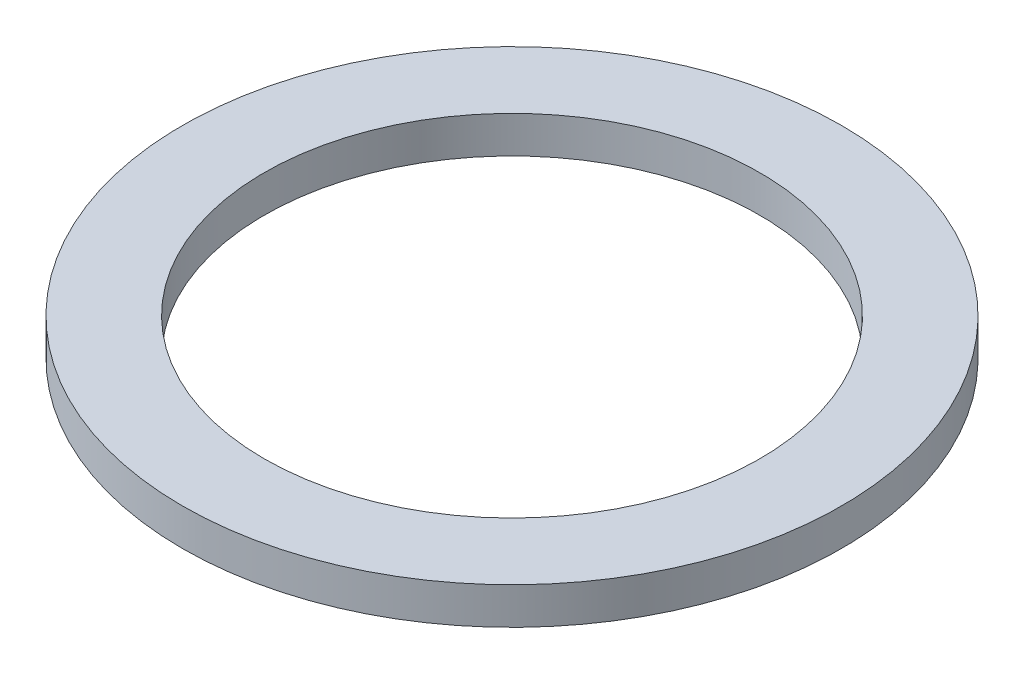
ISO-10303-21;
HEADER;
FILE_DESCRIPTION(('STEP AP214'),'2;1');
FILE_NAME('part.step','',(''),(''),'','','');
FILE_SCHEMA(('AUTOMOTIVE_DESIGN { 1 0 10303 214 1 1 1 1 }'));
ENDSEC;
DATA;
#1=APPLICATION_CONTEXT('core data for automotive mechanical design processes');
#2=APPLICATION_PROTOCOL_DEFINITION('international standard','automotive_design',2000,#1);
#3=PRODUCT_CONTEXT('',#1,'mechanical');
#4=PRODUCT('Part','Part','',(#3));
#5=PRODUCT_RELATED_PRODUCT_CATEGORY('part','',(#4));
#6=PRODUCT_DEFINITION_FORMATION('','',#4);
#7=PRODUCT_DEFINITION_CONTEXT('part definition',#1,'design');
#8=PRODUCT_DEFINITION('design','',#6,#7);
#9=PRODUCT_DEFINITION_SHAPE('','',#8);
#10=(LENGTH_UNIT() NAMED_UNIT(*) SI_UNIT(.MILLI.,.METRE.));
#11=(NAMED_UNIT(*) PLANE_ANGLE_UNIT() SI_UNIT($,.RADIAN.));
#12=(NAMED_UNIT(*) SI_UNIT($,.STERADIAN.) SOLID_ANGLE_UNIT());
#13=UNCERTAINTY_MEASURE_WITH_UNIT(LENGTH_MEASURE(1.E-05),#10,'distance_accuracy_value','');
#14=(GEOMETRIC_REPRESENTATION_CONTEXT(3) GLOBAL_UNCERTAINTY_ASSIGNED_CONTEXT((#13)) GLOBAL_UNIT_ASSIGNED_CONTEXT((#10,
#11,#12)) REPRESENTATION_CONTEXT('',''));
#15=CARTESIAN_POINT('',(0.,0.,0.));
#16=DIRECTION('',(0.,0.,1.));
#17=DIRECTION('',(1.,0.,0.));
#18=AXIS2_PLACEMENT_3D('',#15,#16,#17);
#19=CARTESIAN_POINT('',(0.,0.3556,0.));
#20=DIRECTION('',(0.,1.,0.));
#21=DIRECTION('',(0.,0.,1.));
#22=AXIS2_PLACEMENT_3D('',#19,#20,#21);
#23=PLANE('',#22);
#24=CARTESIAN_POINT('',(0.,0.3556,0.));
#25=DIRECTION('',(0.,1.,0.));
#26=DIRECTION('',(0.,0.,1.));
#27=AXIS2_PLACEMENT_3D('',#24,#25,#26);
#28=CIRCLE('',#27,3.175);
#29=CARTESIAN_POINT('',(0.,0.3556,3.175));
#30=VERTEX_POINT('',#29);
#31=EDGE_CURVE('E10',#30,#30,#28,.T.);
#32=ORIENTED_EDGE('',*,*,#31,.T.);
#33=EDGE_LOOP('',(#32));
#34=FACE_BOUND('',#33,.T.);
#35=CARTESIAN_POINT('',(0.,0.3556,0.));
#36=DIRECTION('',(0.,1.,0.));
#37=DIRECTION('',(0.,0.,1.));
#38=AXIS2_PLACEMENT_3D('',#35,#36,#37);
#39=CIRCLE('',#38,2.3876);
#40=CARTESIAN_POINT('',(0.,0.3556,2.3876));
#41=VERTEX_POINT('',#40);
#42=EDGE_CURVE('E42',#41,#41,#39,.T.);
#43=ORIENTED_EDGE('',*,*,#42,.F.);
#44=EDGE_LOOP('',(#43));
#45=FACE_BOUND('',#44,.T.);
#46=ADVANCED_FACE('F31',(#34,#45),#23,.T.);
#47=CARTESIAN_POINT('',(0.,0.,0.));
#48=DIRECTION('',(0.,1.,0.));
#49=DIRECTION('',(0.,0.,1.));
#50=AXIS2_PLACEMENT_3D('',#47,#48,#49);
#51=PLANE('',#50);
#52=CARTESIAN_POINT('',(0.,0.,0.));
#53=DIRECTION('',(0.,1.,0.));
#54=DIRECTION('',(0.,0.,1.));
#55=AXIS2_PLACEMENT_3D('',#52,#53,#54);
#56=CIRCLE('',#55,3.175);
#57=CARTESIAN_POINT('',(0.,0.,3.175));
#58=VERTEX_POINT('',#57);
#59=EDGE_CURVE('E35',#58,#58,#56,.T.);
#60=ORIENTED_EDGE('',*,*,#59,.F.);
#61=EDGE_LOOP('',(#60));
#62=FACE_BOUND('',#61,.T.);
#63=CARTESIAN_POINT('',(0.,0.,0.));
#64=DIRECTION('',(0.,1.,0.));
#65=DIRECTION('',(0.,0.,1.));
#66=AXIS2_PLACEMENT_3D('',#63,#64,#65);
#67=CIRCLE('',#66,2.3876);
#68=CARTESIAN_POINT('',(0.,0.,2.3876));
#69=VERTEX_POINT('',#68);
#70=EDGE_CURVE('E44',#69,#69,#67,.T.);
#71=ORIENTED_EDGE('',*,*,#70,.T.);
#72=EDGE_LOOP('',(#71));
#73=FACE_BOUND('',#72,.T.);
#74=ADVANCED_FACE('F54',(#62,#73),#51,.F.);
#75=CARTESIAN_POINT('',(0.,0.3556,0.));
#76=DIRECTION('',(0.,-1.,0.));
#77=DIRECTION('',(0.,0.,-1.));
#78=AXIS2_PLACEMENT_3D('',#75,#76,#77);
#79=CYLINDRICAL_SURFACE('',#78,3.175);
#80=ORIENTED_EDGE('',*,*,#31,.F.);
#81=EDGE_LOOP('',(#80));
#82=FACE_BOUND('',#81,.T.);
#83=ORIENTED_EDGE('',*,*,#59,.T.);
#84=EDGE_LOOP('',(#83));
#85=FACE_BOUND('',#84,.T.);
#86=ADVANCED_FACE('F33',(#82,#85),#79,.T.);
#87=CARTESIAN_POINT('',(0.,0.3556,0.));
#88=DIRECTION('',(0.,-1.,0.));
#89=DIRECTION('',(0.,0.,-1.));
#90=AXIS2_PLACEMENT_3D('',#87,#88,#89);
#91=CYLINDRICAL_SURFACE('',#90,2.3876);
#92=ORIENTED_EDGE('',*,*,#42,.T.);
#93=EDGE_LOOP('',(#92));
#94=FACE_BOUND('',#93,.T.);
#95=ORIENTED_EDGE('',*,*,#70,.F.);
#96=EDGE_LOOP('',(#95));
#97=FACE_BOUND('',#96,.T.);
#98=ADVANCED_FACE('F50',(#94,#97),#91,.F.);
#99=CLOSED_SHELL('',(#46,#74,#86,#98));
#100=MANIFOLD_SOLID_BREP('B2',#99);
#101=ADVANCED_BREP_SHAPE_REPRESENTATION('',(#18,#100),#14);
#102=SHAPE_DEFINITION_REPRESENTATION(#9,#101);
ENDSEC;
END-ISO-10303-21;
